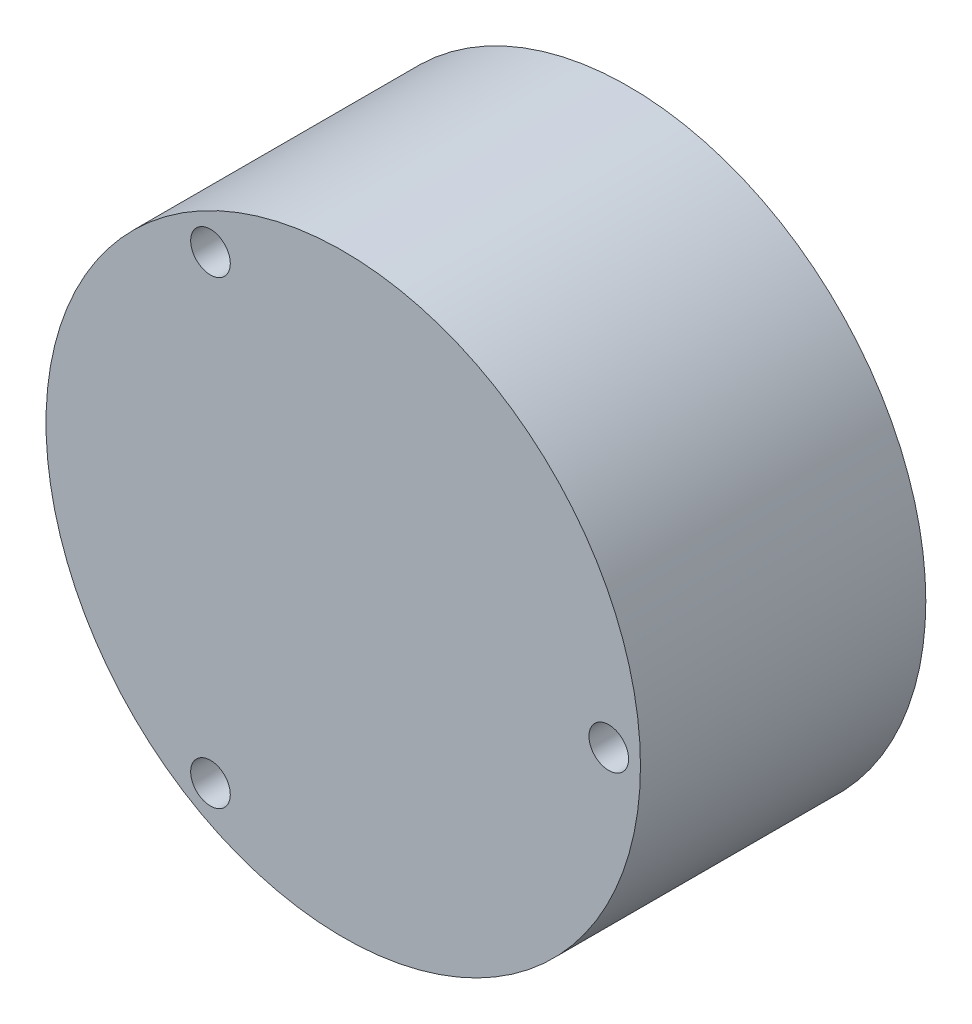
ISO-10303-21;
HEADER;
FILE_DESCRIPTION(('STEP AP214'),'2;1');
FILE_NAME('part.step','',(''),(''),'','','');
FILE_SCHEMA(('AUTOMOTIVE_DESIGN { 1 0 10303 214 1 1 1 1 }'));
ENDSEC;
DATA;
#1=APPLICATION_CONTEXT('core data for automotive mechanical design processes');
#2=APPLICATION_PROTOCOL_DEFINITION('international standard','automotive_design',2000,#1);
#3=PRODUCT_CONTEXT('',#1,'mechanical');
#4=PRODUCT('Part','Part','',(#3));
#5=PRODUCT_RELATED_PRODUCT_CATEGORY('part','',(#4));
#6=PRODUCT_DEFINITION_FORMATION('','',#4);
#7=PRODUCT_DEFINITION_CONTEXT('part definition',#1,'design');
#8=PRODUCT_DEFINITION('design','',#6,#7);
#9=PRODUCT_DEFINITION_SHAPE('','',#8);
#10=(LENGTH_UNIT() NAMED_UNIT(*) SI_UNIT(.MILLI.,.METRE.));
#11=(NAMED_UNIT(*) PLANE_ANGLE_UNIT() SI_UNIT($,.RADIAN.));
#12=(NAMED_UNIT(*) SI_UNIT($,.STERADIAN.) SOLID_ANGLE_UNIT());
#13=UNCERTAINTY_MEASURE_WITH_UNIT(LENGTH_MEASURE(1.E-05),#10,'distance_accuracy_value','');
#14=(GEOMETRIC_REPRESENTATION_CONTEXT(3) GLOBAL_UNCERTAINTY_ASSIGNED_CONTEXT((#13)) GLOBAL_UNIT_ASSIGNED_CONTEXT((#10,
#11,#12)) REPRESENTATION_CONTEXT('',''));
#15=CARTESIAN_POINT('',(0.,0.,0.));
#16=DIRECTION('',(0.,0.,1.));
#17=DIRECTION('',(1.,0.,0.));
#18=AXIS2_PLACEMENT_3D('',#15,#16,#17);
#19=CARTESIAN_POINT('',(0.,0.,0.));
#20=DIRECTION('',(0.,0.,1.));
#21=DIRECTION('',(1.,0.,0.));
#22=AXIS2_PLACEMENT_3D('',#19,#20,#21);
#23=PLANE('',#22);
#24=CARTESIAN_POINT('',(-8.37499999999982,14.5059255133895,0.));
#25=DIRECTION('',(0.,0.,-1.));
#26=DIRECTION('',(-1.,0.,0.));
#27=AXIS2_PLACEMENT_3D('',#24,#25,#26);
#28=CIRCLE('',#27,1.25);
#29=CARTESIAN_POINT('',(-9.62499999999982,14.5059255133895,0.));
#30=VERTEX_POINT('',#29);
#31=EDGE_CURVE('E149',#30,#30,#28,.T.);
#32=ORIENTED_EDGE('',*,*,#31,.F.);
#33=EDGE_LOOP('',(#32));
#34=FACE_BOUND('',#33,.T.);
#35=CARTESIAN_POINT('',(-8.37500000000143,-14.5059255133892,0.));
#36=DIRECTION('',(0.,0.,-1.));
#37=DIRECTION('',(-1.,0.,0.));
#38=AXIS2_PLACEMENT_3D('',#35,#36,#37);
#39=CIRCLE('',#38,1.25000000000093);
#40=CARTESIAN_POINT('',(-9.62500000000236,-14.5059255133892,0.));
#41=VERTEX_POINT('',#40);
#42=EDGE_CURVE('E281',#41,#41,#39,.T.);
#43=ORIENTED_EDGE('',*,*,#42,.F.);
#44=EDGE_LOOP('',(#43));
#45=FACE_BOUND('',#44,.T.);
#46=CARTESIAN_POINT('',(16.7499999999994,-1.29063426612674E-12,0.));
#47=DIRECTION('',(0.,0.,-1.));
#48=DIRECTION('',(-1.,0.,0.));
#49=AXIS2_PLACEMENT_3D('',#46,#47,#48);
#50=CIRCLE('',#49,1.25000000000136);
#51=CARTESIAN_POINT('',(15.499999999998,-1.29063426612674E-12,0.));
#52=VERTEX_POINT('',#51);
#53=EDGE_CURVE('E164',#52,#52,#50,.T.);
#54=ORIENTED_EDGE('',*,*,#53,.F.);
#55=EDGE_LOOP('',(#54));
#56=FACE_BOUND('',#55,.T.);
#57=CARTESIAN_POINT('',(0.,0.,0.));
#58=DIRECTION('',(0.,0.,1.));
#59=DIRECTION('',(1.,0.,0.));
#60=AXIS2_PLACEMENT_3D('',#57,#58,#59);
#61=CIRCLE('',#60,18.75);
#62=CARTESIAN_POINT('',(18.75,0.,0.));
#63=VERTEX_POINT('',#62);
#64=EDGE_CURVE('E124',#63,#63,#61,.T.);
#65=ORIENTED_EDGE('',*,*,#64,.F.);
#66=EDGE_LOOP('',(#65));
#67=FACE_BOUND('',#66,.T.);
#68=CARTESIAN_POINT('',(16.625,-2.2811613709095E-13,0.));
#69=DIRECTION('',(0.,0.,1.));
#70=DIRECTION('',(1.,0.,0.));
#71=AXIS2_PLACEMENT_3D('',#68,#69,#70);
#72=CIRCLE('',#71,1.79321693557213);
#73=CARTESIAN_POINT('',(17.2169924217136,-1.69268188111563,0.));
#74=VERTEX_POINT('',#73);
#75=CARTESIAN_POINT('',(17.2169924217136,1.69268188111516,0.));
#76=VERTEX_POINT('',#75);
#77=EDGE_CURVE('E49',#74,#76,#72,.F.);
#78=ORIENTED_EDGE('',*,*,#77,.T.);
#79=CARTESIAN_POINT('',(0.,0.,0.));
#80=DIRECTION('',(0.,0.,1.));
#81=DIRECTION('',(1.,0.,0.));
#82=AXIS2_PLACEMENT_3D('',#79,#80,#81);
#83=CIRCLE('',#82,17.3);
#84=CARTESIAN_POINT('',(-7.1425907012851,15.7566937545259,0.));
#85=VERTEX_POINT('',#84);
#86=EDGE_CURVE('E11',#76,#85,#83,.T.);
#87=ORIENTED_EDGE('',*,*,#86,.T.);
#88=CARTESIAN_POINT('',(-8.31249999999987,14.3976723379164,0.));
#89=DIRECTION('',(0.,0.,1.));
#90=DIRECTION('',(1.,0.,0.));
#91=AXIS2_PLACEMENT_3D('',#88,#89,#90);
#92=CIRCLE('',#91,1.79321693557213);
#93=CARTESIAN_POINT('',(-10.0744017204282,14.0640118734105,0.));
#94=VERTEX_POINT('',#93);
#95=EDGE_CURVE('E112',#85,#94,#92,.F.);
#96=ORIENTED_EDGE('',*,*,#95,.T.);
#97=CARTESIAN_POINT('',(0.,0.,0.));
#98=DIRECTION('',(0.,0.,1.));
#99=DIRECTION('',(1.,0.,0.));
#100=AXIS2_PLACEMENT_3D('',#97,#98,#99);
#101=CIRCLE('',#100,17.3);
#102=CARTESIAN_POINT('',(-10.0744017204284,-14.0640118734104,0.));
#103=VERTEX_POINT('',#102);
#104=EDGE_CURVE('E130',#94,#103,#101,.T.);
#105=ORIENTED_EDGE('',*,*,#104,.T.);
#106=CARTESIAN_POINT('',(-8.31250000000007,-14.3976723379163,0.));
#107=DIRECTION('',(0.,0.,1.));
#108=DIRECTION('',(1.,0.,0.));
#109=AXIS2_PLACEMENT_3D('',#106,#107,#108);
#110=CIRCLE('',#109,1.79321693557213);
#111=CARTESIAN_POINT('',(-7.14259070128531,-15.7566937545258,0.));
#112=VERTEX_POINT('',#111);
#113=EDGE_CURVE('E134',#103,#112,#110,.F.);
#114=ORIENTED_EDGE('',*,*,#113,.T.);
#115=CARTESIAN_POINT('',(0.,0.,0.));
#116=DIRECTION('',(0.,0.,1.));
#117=DIRECTION('',(1.,0.,0.));
#118=AXIS2_PLACEMENT_3D('',#115,#116,#117);
#119=CIRCLE('',#118,17.3);
#120=EDGE_CURVE('E138',#112,#74,#119,.T.);
#121=ORIENTED_EDGE('',*,*,#120,.T.);
#122=EDGE_LOOP('',(#78,#87,#96,#105,#114,#121));
#123=FACE_BOUND('',#122,.T.);
#124=ADVANCED_FACE('F39',(#34,#45,#56,#67,#123),#23,.F.);
#125=CARTESIAN_POINT('',(0.,0.,16.));
#126=DIRECTION('',(0.,0.,-1.));
#127=DIRECTION('',(-1.,0.,0.));
#128=AXIS2_PLACEMENT_3D('',#125,#126,#127);
#129=CYLINDRICAL_SURFACE('',#128,18.75);
#130=ORIENTED_EDGE('',*,*,#64,.T.);
#131=EDGE_LOOP('',(#130));
#132=FACE_BOUND('',#131,.T.);
#133=CARTESIAN_POINT('',(0.,0.,18.));
#134=DIRECTION('',(0.,0.,1.));
#135=DIRECTION('',(1.,0.,0.));
#136=AXIS2_PLACEMENT_3D('',#133,#134,#135);
#137=CIRCLE('',#136,18.75);
#138=CARTESIAN_POINT('',(18.75,0.,18.));
#139=VERTEX_POINT('',#138);
#140=EDGE_CURVE('E108',#139,#139,#137,.T.);
#141=ORIENTED_EDGE('',*,*,#140,.F.);
#142=EDGE_LOOP('',(#141));
#143=FACE_BOUND('',#142,.T.);
#144=ADVANCED_FACE('F41',(#132,#143),#129,.T.);
#145=CARTESIAN_POINT('',(0.,0.,-2.));
#146=DIRECTION('',(0.,0.,1.));
#147=DIRECTION('',(1.,0.,0.));
#148=AXIS2_PLACEMENT_3D('',#145,#146,#147);
#149=CYLINDRICAL_SURFACE('',#148,17.3);
#150=DIRECTION('',(0.,0.,1.));
#151=VECTOR('',#150,1.);
#152=CARTESIAN_POINT('',(17.2169924217136,1.69268188111516,-2.));
#153=LINE('',#152,#151);
#154=CARTESIAN_POINT('',(17.2169924217136,1.69268188111516,16.));
#155=VERTEX_POINT('',#154);
#156=EDGE_CURVE('E105',#76,#155,#153,.T.);
#157=ORIENTED_EDGE('',*,*,#156,.T.);
#158=CARTESIAN_POINT('',(0.,0.,16.));
#159=DIRECTION('',(0.,0.,1.));
#160=DIRECTION('',(1.,0.,0.));
#161=AXIS2_PLACEMENT_3D('',#158,#159,#160);
#162=CIRCLE('',#161,17.3);
#163=CARTESIAN_POINT('',(-7.1425907012851,15.7566937545259,16.));
#164=VERTEX_POINT('',#163);
#165=EDGE_CURVE('E97',#155,#164,#162,.T.);
#166=ORIENTED_EDGE('',*,*,#165,.T.);
#167=DIRECTION('',(0.,0.,1.));
#168=VECTOR('',#167,1.);
#169=CARTESIAN_POINT('',(-7.1425907012851,15.7566937545259,-2.));
#170=LINE('',#169,#168);
#171=EDGE_CURVE('E104',#85,#164,#170,.T.);
#172=ORIENTED_EDGE('',*,*,#171,.F.);
#173=ORIENTED_EDGE('',*,*,#86,.F.);
#174=EDGE_LOOP('',(#157,#166,#172,#173));
#175=FACE_BOUND('',#174,.T.);
#176=ADVANCED_FACE('F103',(#175),#149,.F.);
#177=CARTESIAN_POINT('',(16.625,-2.2811613709095E-13,-2.));
#178=DIRECTION('',(0.,0.,1.));
#179=DIRECTION('',(1.,0.,0.));
#180=AXIS2_PLACEMENT_3D('',#177,#178,#179);
#181=CYLINDRICAL_SURFACE('',#180,1.79321693557213);
#182=DIRECTION('',(0.,0.,1.));
#183=VECTOR('',#182,1.);
#184=CARTESIAN_POINT('',(17.2169924217136,-1.69268188111563,-2.));
#185=LINE('',#184,#183);
#186=CARTESIAN_POINT('',(17.2169924217136,-1.69268188111563,16.));
#187=VERTEX_POINT('',#186);
#188=EDGE_CURVE('E178',#74,#187,#185,.T.);
#189=ORIENTED_EDGE('',*,*,#188,.T.);
#190=CARTESIAN_POINT('',(16.625,-2.2811613709095E-13,16.));
#191=DIRECTION('',(0.,0.,-1.));
#192=DIRECTION('',(1.,0.,0.));
#193=AXIS2_PLACEMENT_3D('',#190,#191,#192);
#194=CIRCLE('',#193,1.79321693557213);
#195=EDGE_CURVE('E114',#187,#155,#194,.T.);
#196=ORIENTED_EDGE('',*,*,#195,.T.);
#197=ORIENTED_EDGE('',*,*,#156,.F.);
#198=ORIENTED_EDGE('',*,*,#77,.F.);
#199=EDGE_LOOP('',(#189,#196,#197,#198));
#200=FACE_BOUND('',#199,.T.);
#201=ADVANCED_FACE('F196',(#200),#181,.T.);
#202=CARTESIAN_POINT('',(0.,0.,-2.));
#203=DIRECTION('',(0.,0.,1.));
#204=DIRECTION('',(1.,0.,0.));
#205=AXIS2_PLACEMENT_3D('',#202,#203,#204);
#206=CYLINDRICAL_SURFACE('',#205,17.3);
#207=DIRECTION('',(0.,0.,1.));
#208=VECTOR('',#207,1.);
#209=CARTESIAN_POINT('',(-7.14259070128531,-15.7566937545258,-2.));
#210=LINE('',#209,#208);
#211=CARTESIAN_POINT('',(-7.14259070128531,-15.7566937545258,16.));
#212=VERTEX_POINT('',#211);
#213=EDGE_CURVE('E182',#112,#212,#210,.T.);
#214=ORIENTED_EDGE('',*,*,#213,.T.);
#215=CARTESIAN_POINT('',(0.,0.,16.));
#216=DIRECTION('',(0.,0.,1.));
#217=DIRECTION('',(1.,0.,0.));
#218=AXIS2_PLACEMENT_3D('',#215,#216,#217);
#219=CIRCLE('',#218,17.3);
#220=EDGE_CURVE('E120',#212,#187,#219,.T.);
#221=ORIENTED_EDGE('',*,*,#220,.T.);
#222=ORIENTED_EDGE('',*,*,#188,.F.);
#223=ORIENTED_EDGE('',*,*,#120,.F.);
#224=EDGE_LOOP('',(#214,#221,#222,#223));
#225=FACE_BOUND('',#224,.T.);
#226=ADVANCED_FACE('F198',(#225),#206,.F.);
#227=CARTESIAN_POINT('',(-8.31250000000007,-14.3976723379163,-2.));
#228=DIRECTION('',(0.,0.,1.));
#229=DIRECTION('',(1.,0.,0.));
#230=AXIS2_PLACEMENT_3D('',#227,#228,#229);
#231=CYLINDRICAL_SURFACE('',#230,1.79321693557213);
#232=DIRECTION('',(0.,0.,1.));
#233=VECTOR('',#232,1.);
#234=CARTESIAN_POINT('',(-10.0744017204284,-14.0640118734104,-2.));
#235=LINE('',#234,#233);
#236=CARTESIAN_POINT('',(-10.0744017204284,-14.0640118734104,16.));
#237=VERTEX_POINT('',#236);
#238=EDGE_CURVE('E118',#103,#237,#235,.T.);
#239=ORIENTED_EDGE('',*,*,#238,.T.);
#240=CARTESIAN_POINT('',(-8.31250000000007,-14.3976723379163,16.));
#241=DIRECTION('',(0.,0.,-1.));
#242=DIRECTION('',(1.,0.,0.));
#243=AXIS2_PLACEMENT_3D('',#240,#241,#242);
#244=CIRCLE('',#243,1.79321693557213);
#245=EDGE_CURVE('E169',#237,#212,#244,.T.);
#246=ORIENTED_EDGE('',*,*,#245,.T.);
#247=ORIENTED_EDGE('',*,*,#213,.F.);
#248=ORIENTED_EDGE('',*,*,#113,.F.);
#249=EDGE_LOOP('',(#239,#246,#247,#248));
#250=FACE_BOUND('',#249,.T.);
#251=ADVANCED_FACE('F189',(#250),#231,.T.);
#252=CARTESIAN_POINT('',(0.,0.,-2.));
#253=DIRECTION('',(0.,0.,1.));
#254=DIRECTION('',(1.,0.,0.));
#255=AXIS2_PLACEMENT_3D('',#252,#253,#254);
#256=CYLINDRICAL_SURFACE('',#255,17.3);
#257=DIRECTION('',(0.,0.,1.));
#258=VECTOR('',#257,1.);
#259=CARTESIAN_POINT('',(-10.0744017204282,14.0640118734105,-2.));
#260=LINE('',#259,#258);
#261=CARTESIAN_POINT('',(-10.0744017204282,14.0640118734105,16.));
#262=VERTEX_POINT('',#261);
#263=EDGE_CURVE('E57',#94,#262,#260,.T.);
#264=ORIENTED_EDGE('',*,*,#263,.T.);
#265=CARTESIAN_POINT('',(0.,0.,16.));
#266=DIRECTION('',(0.,0.,1.));
#267=DIRECTION('',(1.,0.,0.));
#268=AXIS2_PLACEMENT_3D('',#265,#266,#267);
#269=CIRCLE('',#268,17.3);
#270=EDGE_CURVE('E99',#262,#237,#269,.T.);
#271=ORIENTED_EDGE('',*,*,#270,.T.);
#272=ORIENTED_EDGE('',*,*,#238,.F.);
#273=ORIENTED_EDGE('',*,*,#104,.F.);
#274=EDGE_LOOP('',(#264,#271,#272,#273));
#275=FACE_BOUND('',#274,.T.);
#276=ADVANCED_FACE('F192',(#275),#256,.F.);
#277=CARTESIAN_POINT('',(-8.31249999999987,14.3976723379164,-2.));
#278=DIRECTION('',(0.,0.,1.));
#279=DIRECTION('',(1.,0.,0.));
#280=AXIS2_PLACEMENT_3D('',#277,#278,#279);
#281=CYLINDRICAL_SURFACE('',#280,1.79321693557213);
#282=ORIENTED_EDGE('',*,*,#171,.T.);
#283=CARTESIAN_POINT('',(-8.31249999999987,14.3976723379164,16.));
#284=DIRECTION('',(0.,0.,-1.));
#285=DIRECTION('',(1.,0.,0.));
#286=AXIS2_PLACEMENT_3D('',#283,#284,#285);
#287=CIRCLE('',#286,1.79321693557213);
#288=EDGE_CURVE('E94',#164,#262,#287,.T.);
#289=ORIENTED_EDGE('',*,*,#288,.T.);
#290=ORIENTED_EDGE('',*,*,#263,.F.);
#291=ORIENTED_EDGE('',*,*,#95,.F.);
#292=EDGE_LOOP('',(#282,#289,#290,#291));
#293=FACE_BOUND('',#292,.T.);
#294=ADVANCED_FACE('F110',(#293),#281,.T.);
#295=CARTESIAN_POINT('',(0.,0.,16.));
#296=DIRECTION('',(0.,0.,1.));
#297=DIRECTION('',(1.,0.,0.));
#298=AXIS2_PLACEMENT_3D('',#295,#296,#297);
#299=PLANE('',#298);
#300=ORIENTED_EDGE('',*,*,#165,.F.);
#301=ORIENTED_EDGE('',*,*,#195,.F.);
#302=ORIENTED_EDGE('',*,*,#220,.F.);
#303=ORIENTED_EDGE('',*,*,#245,.F.);
#304=ORIENTED_EDGE('',*,*,#270,.F.);
#305=ORIENTED_EDGE('',*,*,#288,.F.);
#306=EDGE_LOOP('',(#300,#301,#302,#303,#304,#305));
#307=FACE_BOUND('',#306,.T.);
#308=ADVANCED_FACE('F96',(#307),#299,.F.);
#309=CARTESIAN_POINT('',(0.,0.,18.));
#310=DIRECTION('',(0.,0.,1.));
#311=DIRECTION('',(1.,0.,0.));
#312=AXIS2_PLACEMENT_3D('',#309,#310,#311);
#313=PLANE('',#312);
#314=CARTESIAN_POINT('',(-8.37499999999982,14.5059255133895,18.));
#315=DIRECTION('',(0.,0.,1.));
#316=DIRECTION('',(1.,0.,0.));
#317=AXIS2_PLACEMENT_3D('',#314,#315,#316);
#318=CIRCLE('',#317,1.25);
#319=CARTESIAN_POINT('',(-7.12499999999981,14.5059255133895,18.));
#320=VERTEX_POINT('',#319);
#321=EDGE_CURVE('E43',#320,#320,#318,.T.);
#322=ORIENTED_EDGE('',*,*,#321,.F.);
#323=EDGE_LOOP('',(#322));
#324=FACE_BOUND('',#323,.T.);
#325=CARTESIAN_POINT('',(-8.37500000000143,-14.5059255133892,18.));
#326=DIRECTION('',(0.,0.,1.));
#327=DIRECTION('',(1.,0.,0.));
#328=AXIS2_PLACEMENT_3D('',#325,#326,#327);
#329=CIRCLE('',#328,1.25000000000093);
#330=CARTESIAN_POINT('',(-7.12500000000049,-14.5059255133892,18.));
#331=VERTEX_POINT('',#330);
#332=EDGE_CURVE('E148',#331,#331,#329,.T.);
#333=ORIENTED_EDGE('',*,*,#332,.F.);
#334=EDGE_LOOP('',(#333));
#335=FACE_BOUND('',#334,.T.);
#336=CARTESIAN_POINT('',(16.7499999999994,-1.29063426612674E-12,18.));
#337=DIRECTION('',(0.,0.,1.));
#338=DIRECTION('',(1.,0.,0.));
#339=AXIS2_PLACEMENT_3D('',#336,#337,#338);
#340=CIRCLE('',#339,1.25000000000136);
#341=CARTESIAN_POINT('',(18.0000000000007,-1.29063426612674E-12,18.));
#342=VERTEX_POINT('',#341);
#343=EDGE_CURVE('E145',#342,#342,#340,.T.);
#344=ORIENTED_EDGE('',*,*,#343,.F.);
#345=EDGE_LOOP('',(#344));
#346=FACE_BOUND('',#345,.T.);
#347=ORIENTED_EDGE('',*,*,#140,.T.);
#348=EDGE_LOOP('',(#347));
#349=FACE_BOUND('',#348,.T.);
#350=ADVANCED_FACE('F236',(#324,#335,#346,#349),#313,.T.);
#351=CARTESIAN_POINT('',(16.7499999999994,-1.29063426612674E-12,20.));
#352=DIRECTION('',(0.,0.,-1.));
#353=DIRECTION('',(-1.,0.,0.));
#354=AXIS2_PLACEMENT_3D('',#351,#352,#353);
#355=CYLINDRICAL_SURFACE('',#354,1.25000000000136);
#356=ORIENTED_EDGE('',*,*,#343,.T.);
#357=EDGE_LOOP('',(#356));
#358=FACE_BOUND('',#357,.T.);
#359=ORIENTED_EDGE('',*,*,#53,.T.);
#360=EDGE_LOOP('',(#359));
#361=FACE_BOUND('',#360,.T.);
#362=ADVANCED_FACE('F243',(#358,#361),#355,.F.);
#363=CARTESIAN_POINT('',(-8.37500000000143,-14.5059255133892,20.));
#364=DIRECTION('',(0.,0.,-1.));
#365=DIRECTION('',(-1.,0.,0.));
#366=AXIS2_PLACEMENT_3D('',#363,#364,#365);
#367=CYLINDRICAL_SURFACE('',#366,1.25000000000093);
#368=ORIENTED_EDGE('',*,*,#332,.T.);
#369=EDGE_LOOP('',(#368));
#370=FACE_BOUND('',#369,.T.);
#371=ORIENTED_EDGE('',*,*,#42,.T.);
#372=EDGE_LOOP('',(#371));
#373=FACE_BOUND('',#372,.T.);
#374=ADVANCED_FACE('F256',(#370,#373),#367,.F.);
#375=CARTESIAN_POINT('',(-8.37499999999982,14.5059255133895,20.));
#376=DIRECTION('',(0.,0.,-1.));
#377=DIRECTION('',(-1.,0.,0.));
#378=AXIS2_PLACEMENT_3D('',#375,#376,#377);
#379=CYLINDRICAL_SURFACE('',#378,1.25);
#380=ORIENTED_EDGE('',*,*,#321,.T.);
#381=EDGE_LOOP('',(#380));
#382=FACE_BOUND('',#381,.T.);
#383=ORIENTED_EDGE('',*,*,#31,.T.);
#384=EDGE_LOOP('',(#383));
#385=FACE_BOUND('',#384,.T.);
#386=ADVANCED_FACE('F266',(#382,#385),#379,.F.);
#387=CLOSED_SHELL('',(#124,#144,#176,#201,#226,#251,#276,#294,#308,#350,#362,#374,#386));
#388=MANIFOLD_SOLID_BREP('B2',#387);
#389=ADVANCED_BREP_SHAPE_REPRESENTATION('',(#18,#388),#14);
#390=SHAPE_DEFINITION_REPRESENTATION(#9,#389);
ENDSEC;
END-ISO-10303-21;
